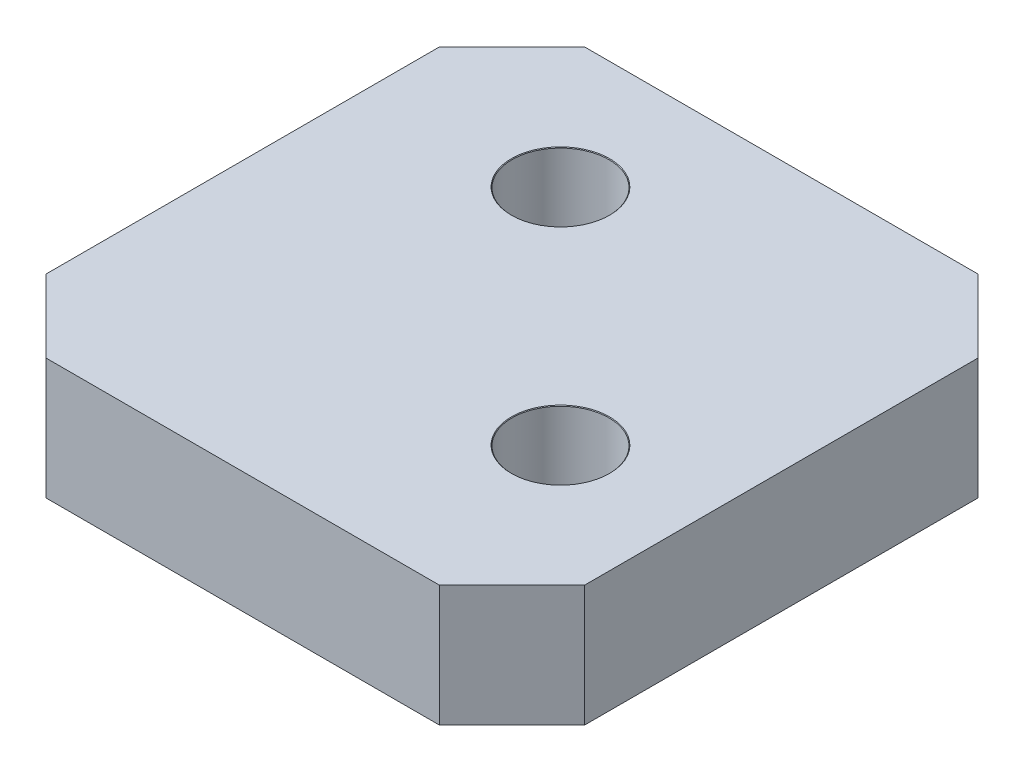
ISO-10303-21;
HEADER;
FILE_DESCRIPTION(('STEP AP214'),'2;1');
FILE_NAME('part.step','',(''),(''),'','','');
FILE_SCHEMA(('AUTOMOTIVE_DESIGN { 1 0 10303 214 1 1 1 1 }'));
ENDSEC;
DATA;
#1=APPLICATION_CONTEXT('core data for automotive mechanical design processes');
#2=APPLICATION_PROTOCOL_DEFINITION('international standard','automotive_design',2000,#1);
#3=PRODUCT_CONTEXT('',#1,'mechanical');
#4=PRODUCT('Part','Part','',(#3));
#5=PRODUCT_RELATED_PRODUCT_CATEGORY('part','',(#4));
#6=PRODUCT_DEFINITION_FORMATION('','',#4);
#7=PRODUCT_DEFINITION_CONTEXT('part definition',#1,'design');
#8=PRODUCT_DEFINITION('design','',#6,#7);
#9=PRODUCT_DEFINITION_SHAPE('','',#8);
#10=(LENGTH_UNIT() NAMED_UNIT(*) SI_UNIT(.MILLI.,.METRE.));
#11=(NAMED_UNIT(*) PLANE_ANGLE_UNIT() SI_UNIT($,.RADIAN.));
#12=(NAMED_UNIT(*) SI_UNIT($,.STERADIAN.) SOLID_ANGLE_UNIT());
#13=UNCERTAINTY_MEASURE_WITH_UNIT(LENGTH_MEASURE(1.E-05),#10,'distance_accuracy_value','');
#14=(GEOMETRIC_REPRESENTATION_CONTEXT(3) GLOBAL_UNCERTAINTY_ASSIGNED_CONTEXT((#13)) GLOBAL_UNIT_ASSIGNED_CONTEXT((#10,
#11,#12)) REPRESENTATION_CONTEXT('',''));
#15=CARTESIAN_POINT('',(0.,0.,0.));
#16=DIRECTION('',(0.,0.,1.));
#17=DIRECTION('',(1.,0.,0.));
#18=AXIS2_PLACEMENT_3D('',#15,#16,#17);
#19=CARTESIAN_POINT('',(0.,5.,0.));
#20=DIRECTION('',(1.,0.,0.));
#21=DIRECTION('',(0.,0.,-1.));
#22=AXIS2_PLACEMENT_3D('',#19,#20,#21);
#23=PLANE('',#22);
#24=DIRECTION('',(0.,0.,1.));
#25=VECTOR('',#24,1.);
#26=CARTESIAN_POINT('',(0.,0.,0.));
#27=LINE('',#26,#25);
#28=CARTESIAN_POINT('',(0.,0.,-19.225));
#29=VERTEX_POINT('',#28);
#30=CARTESIAN_POINT('',(0.,0.,-3.00000000000001));
#31=VERTEX_POINT('',#30);
#32=EDGE_CURVE('E129',#29,#31,#27,.T.);
#33=ORIENTED_EDGE('',*,*,#32,.T.);
#34=DIRECTION('',(0.,1.,0.));
#35=VECTOR('',#34,1.);
#36=CARTESIAN_POINT('',(0.,5.,-3.00000000000001));
#37=LINE('',#36,#35);
#38=CARTESIAN_POINT('',(0.,5.,-3.00000000000001));
#39=VERTEX_POINT('',#38);
#40=EDGE_CURVE('E107',#31,#39,#37,.T.);
#41=ORIENTED_EDGE('',*,*,#40,.T.);
#42=DIRECTION('',(0.,0.,1.));
#43=VECTOR('',#42,1.);
#44=CARTESIAN_POINT('',(0.,5.,0.));
#45=LINE('',#44,#43);
#46=CARTESIAN_POINT('',(0.,5.,-19.225));
#47=VERTEX_POINT('',#46);
#48=EDGE_CURVE('E139',#47,#39,#45,.T.);
#49=ORIENTED_EDGE('',*,*,#48,.F.);
#50=DIRECTION('',(0.,-1.,0.));
#51=VECTOR('',#50,1.);
#52=CARTESIAN_POINT('',(0.,5.,-19.225));
#53=LINE('',#52,#51);
#54=EDGE_CURVE('E112',#47,#29,#53,.T.);
#55=ORIENTED_EDGE('',*,*,#54,.T.);
#56=EDGE_LOOP('',(#33,#41,#49,#55));
#57=FACE_BOUND('',#56,.T.);
#58=ADVANCED_FACE('F35',(#57),#23,.F.);
#59=CARTESIAN_POINT('',(0.,5.,0.));
#60=DIRECTION('',(0.,0.,-1.));
#61=DIRECTION('',(-1.,0.,0.));
#62=AXIS2_PLACEMENT_3D('',#59,#60,#61);
#63=PLANE('',#62);
#64=DIRECTION('',(1.,0.,0.));
#65=VECTOR('',#64,1.);
#66=CARTESIAN_POINT('',(0.,5.,0.));
#67=LINE('',#66,#65);
#68=CARTESIAN_POINT('',(3.,5.,0.));
#69=VERTEX_POINT('',#68);
#70=CARTESIAN_POINT('',(19.225,5.,0.));
#71=VERTEX_POINT('',#70);
#72=EDGE_CURVE('E122',#69,#71,#67,.T.);
#73=ORIENTED_EDGE('',*,*,#72,.F.);
#74=DIRECTION('',(0.,-1.,0.));
#75=VECTOR('',#74,1.);
#76=CARTESIAN_POINT('',(3.,5.,0.));
#77=LINE('',#76,#75);
#78=CARTESIAN_POINT('',(3.,0.,0.));
#79=VERTEX_POINT('',#78);
#80=EDGE_CURVE('E106',#69,#79,#77,.T.);
#81=ORIENTED_EDGE('',*,*,#80,.T.);
#82=DIRECTION('',(1.,0.,0.));
#83=VECTOR('',#82,1.);
#84=CARTESIAN_POINT('',(0.,0.,0.));
#85=LINE('',#84,#83);
#86=CARTESIAN_POINT('',(19.225,0.,0.));
#87=VERTEX_POINT('',#86);
#88=EDGE_CURVE('E119',#79,#87,#85,.T.);
#89=ORIENTED_EDGE('',*,*,#88,.T.);
#90=DIRECTION('',(0.,1.,0.));
#91=VECTOR('',#90,1.);
#92=CARTESIAN_POINT('',(19.225,5.,0.));
#93=LINE('',#92,#91);
#94=EDGE_CURVE('E124',#87,#71,#93,.T.);
#95=ORIENTED_EDGE('',*,*,#94,.T.);
#96=EDGE_LOOP('',(#73,#81,#89,#95));
#97=FACE_BOUND('',#96,.T.);
#98=ADVANCED_FACE('F118',(#97),#63,.F.);
#99=CARTESIAN_POINT('',(22.225,5.,0.));
#100=DIRECTION('',(-1.,0.,0.));
#101=DIRECTION('',(0.,0.,1.));
#102=AXIS2_PLACEMENT_3D('',#99,#100,#101);
#103=PLANE('',#102);
#104=DIRECTION('',(0.,0.,-1.));
#105=VECTOR('',#104,1.);
#106=CARTESIAN_POINT('',(22.225,5.,0.));
#107=LINE('',#106,#105);
#108=CARTESIAN_POINT('',(22.225,5.,-3.));
#109=VERTEX_POINT('',#108);
#110=CARTESIAN_POINT('',(22.225,5.,-19.225));
#111=VERTEX_POINT('',#110);
#112=EDGE_CURVE('E165',#109,#111,#107,.T.);
#113=ORIENTED_EDGE('',*,*,#112,.F.);
#114=DIRECTION('',(0.,-1.,0.));
#115=VECTOR('',#114,1.);
#116=CARTESIAN_POINT('',(22.225,5.,-3.));
#117=LINE('',#116,#115);
#118=CARTESIAN_POINT('',(22.225,0.,-3.));
#119=VERTEX_POINT('',#118);
#120=EDGE_CURVE('E158',#109,#119,#117,.T.);
#121=ORIENTED_EDGE('',*,*,#120,.T.);
#122=DIRECTION('',(0.,0.,-1.));
#123=VECTOR('',#122,1.);
#124=CARTESIAN_POINT('',(22.225,0.,0.));
#125=LINE('',#124,#123);
#126=CARTESIAN_POINT('',(22.225,0.,-19.225));
#127=VERTEX_POINT('',#126);
#128=EDGE_CURVE('E128',#119,#127,#125,.T.);
#129=ORIENTED_EDGE('',*,*,#128,.T.);
#130=DIRECTION('',(0.,1.,0.));
#131=VECTOR('',#130,1.);
#132=CARTESIAN_POINT('',(22.225,5.,-19.225));
#133=LINE('',#132,#131);
#134=EDGE_CURVE('E156',#127,#111,#133,.T.);
#135=ORIENTED_EDGE('',*,*,#134,.T.);
#136=EDGE_LOOP('',(#113,#121,#129,#135));
#137=FACE_BOUND('',#136,.T.);
#138=ADVANCED_FACE('F163',(#137),#103,.F.);
#139=CARTESIAN_POINT('',(0.,5.,-22.225));
#140=DIRECTION('',(0.,0.,1.));
#141=DIRECTION('',(1.,0.,0.));
#142=AXIS2_PLACEMENT_3D('',#139,#140,#141);
#143=PLANE('',#142);
#144=DIRECTION('',(-1.,0.,0.));
#145=VECTOR('',#144,1.);
#146=CARTESIAN_POINT('',(0.,5.,-22.225));
#147=LINE('',#146,#145);
#148=CARTESIAN_POINT('',(19.225,5.,-22.225));
#149=VERTEX_POINT('',#148);
#150=CARTESIAN_POINT('',(3.00000000000001,5.,-22.225));
#151=VERTEX_POINT('',#150);
#152=EDGE_CURVE('E140',#149,#151,#147,.T.);
#153=ORIENTED_EDGE('',*,*,#152,.F.);
#154=DIRECTION('',(0.,-1.,0.));
#155=VECTOR('',#154,1.);
#156=CARTESIAN_POINT('',(19.225,5.,-22.225));
#157=LINE('',#156,#155);
#158=CARTESIAN_POINT('',(19.225,0.,-22.225));
#159=VERTEX_POINT('',#158);
#160=EDGE_CURVE('E11',#149,#159,#157,.T.);
#161=ORIENTED_EDGE('',*,*,#160,.T.);
#162=DIRECTION('',(-1.,0.,0.));
#163=VECTOR('',#162,1.);
#164=CARTESIAN_POINT('',(0.,0.,-22.225));
#165=LINE('',#164,#163);
#166=CARTESIAN_POINT('',(3.00000000000001,0.,-22.225));
#167=VERTEX_POINT('',#166);
#168=EDGE_CURVE('E132',#159,#167,#165,.T.);
#169=ORIENTED_EDGE('',*,*,#168,.T.);
#170=DIRECTION('',(0.,1.,0.));
#171=VECTOR('',#170,1.);
#172=CARTESIAN_POINT('',(3.00000000000001,5.,-22.225));
#173=LINE('',#172,#171);
#174=EDGE_CURVE('E44',#167,#151,#173,.T.);
#175=ORIENTED_EDGE('',*,*,#174,.T.);
#176=EDGE_LOOP('',(#153,#161,#169,#175));
#177=FACE_BOUND('',#176,.T.);
#178=ADVANCED_FACE('F172',(#177),#143,.F.);
#179=CARTESIAN_POINT('',(0.,5.,0.));
#180=DIRECTION('',(0.,-1.,0.));
#181=DIRECTION('',(0.,0.,-1.));
#182=AXIS2_PLACEMENT_3D('',#179,#180,#181);
#183=PLANE('',#182);
#184=CARTESIAN_POINT('',(7.5,5.,-16.725));
#185=DIRECTION('',(0.,1.,0.));
#186=DIRECTION('',(0.,0.,1.));
#187=AXIS2_PLACEMENT_3D('',#184,#185,#186);
#188=CIRCLE('',#187,2.025);
#189=CARTESIAN_POINT('',(7.5,5.,-14.7));
#190=VERTEX_POINT('',#189);
#191=EDGE_CURVE('E193',#190,#190,#188,.T.);
#192=ORIENTED_EDGE('',*,*,#191,.F.);
#193=EDGE_LOOP('',(#192));
#194=FACE_BOUND('',#193,.T.);
#195=CARTESIAN_POINT('',(16.725,5.,-7.5));
#196=DIRECTION('',(0.,1.,0.));
#197=DIRECTION('',(0.,0.,1.));
#198=AXIS2_PLACEMENT_3D('',#195,#196,#197);
#199=CIRCLE('',#198,2.025);
#200=CARTESIAN_POINT('',(16.725,5.,-5.475));
#201=VERTEX_POINT('',#200);
#202=EDGE_CURVE('E184',#201,#201,#199,.T.);
#203=ORIENTED_EDGE('',*,*,#202,.F.);
#204=EDGE_LOOP('',(#203));
#205=FACE_BOUND('',#204,.T.);
#206=ORIENTED_EDGE('',*,*,#48,.T.);
#207=DIRECTION('',(-0.707106781186546,0.,-0.707106781186549));
#208=VECTOR('',#207,1.);
#209=CARTESIAN_POINT('',(3.,5.,0.));
#210=LINE('',#209,#208);
#211=EDGE_CURVE('E154',#39,#69,#210,.F.);
#212=ORIENTED_EDGE('',*,*,#211,.T.);
#213=ORIENTED_EDGE('',*,*,#72,.T.);
#214=DIRECTION('',(-0.707106781186549,0.,0.707106781186546));
#215=VECTOR('',#214,1.);
#216=CARTESIAN_POINT('',(22.225,5.,-3.));
#217=LINE('',#216,#215);
#218=EDGE_CURVE('E152',#71,#109,#217,.F.);
#219=ORIENTED_EDGE('',*,*,#218,.T.);
#220=ORIENTED_EDGE('',*,*,#112,.T.);
#221=DIRECTION('',(0.707106781186547,0.,0.707106781186548));
#222=VECTOR('',#221,1.);
#223=CARTESIAN_POINT('',(19.225,5.,-22.225));
#224=LINE('',#223,#222);
#225=EDGE_CURVE('E57',#111,#149,#224,.F.);
#226=ORIENTED_EDGE('',*,*,#225,.T.);
#227=ORIENTED_EDGE('',*,*,#152,.T.);
#228=DIRECTION('',(0.707106781186549,0.,-0.707106781186546));
#229=VECTOR('',#228,1.);
#230=CARTESIAN_POINT('',(0.,5.,-19.225));
#231=LINE('',#230,#229);
#232=EDGE_CURVE('E149',#151,#47,#231,.F.);
#233=ORIENTED_EDGE('',*,*,#232,.T.);
#234=EDGE_LOOP('',(#206,#212,#213,#219,#220,#226,#227,#233));
#235=FACE_BOUND('',#234,.T.);
#236=ADVANCED_FACE('F199',(#194,#205,#235),#183,.F.);
#237=CARTESIAN_POINT('',(0.,0.,0.));
#238=DIRECTION('',(0.,-1.,0.));
#239=DIRECTION('',(0.,0.,-1.));
#240=AXIS2_PLACEMENT_3D('',#237,#238,#239);
#241=PLANE('',#240);
#242=CARTESIAN_POINT('',(7.5,0.,-16.725));
#243=DIRECTION('',(0.,1.,0.));
#244=DIRECTION('',(0.,0.,1.));
#245=AXIS2_PLACEMENT_3D('',#242,#243,#244);
#246=CIRCLE('',#245,2.);
#247=CARTESIAN_POINT('',(7.5,0.,-14.725));
#248=VERTEX_POINT('',#247);
#249=EDGE_CURVE('E187',#248,#248,#246,.T.);
#250=ORIENTED_EDGE('',*,*,#249,.T.);
#251=EDGE_LOOP('',(#250));
#252=FACE_BOUND('',#251,.T.);
#253=CARTESIAN_POINT('',(16.725,0.,-7.5));
#254=DIRECTION('',(0.,1.,0.));
#255=DIRECTION('',(0.,0.,1.));
#256=AXIS2_PLACEMENT_3D('',#253,#254,#255);
#257=CIRCLE('',#256,2.);
#258=CARTESIAN_POINT('',(16.725,0.,-5.5));
#259=VERTEX_POINT('',#258);
#260=EDGE_CURVE('E134',#259,#259,#257,.T.);
#261=ORIENTED_EDGE('',*,*,#260,.T.);
#262=EDGE_LOOP('',(#261));
#263=FACE_BOUND('',#262,.T.);
#264=ORIENTED_EDGE('',*,*,#88,.F.);
#265=DIRECTION('',(0.707106781186546,0.,0.707106781186549));
#266=VECTOR('',#265,1.);
#267=CARTESIAN_POINT('',(1.5,0.,-1.5));
#268=LINE('',#267,#266);
#269=EDGE_CURVE('E102',#79,#31,#268,.F.);
#270=ORIENTED_EDGE('',*,*,#269,.T.);
#271=ORIENTED_EDGE('',*,*,#32,.F.);
#272=DIRECTION('',(-0.707106781186549,0.,0.707106781186546));
#273=VECTOR('',#272,1.);
#274=CARTESIAN_POINT('',(-9.6125,0.,-9.61250000000003));
#275=LINE('',#274,#273);
#276=EDGE_CURVE('E123',#29,#167,#275,.F.);
#277=ORIENTED_EDGE('',*,*,#276,.T.);
#278=ORIENTED_EDGE('',*,*,#168,.F.);
#279=DIRECTION('',(-0.707106781186547,0.,-0.707106781186548));
#280=VECTOR('',#279,1.);
#281=CARTESIAN_POINT('',(20.725,0.,-20.725));
#282=LINE('',#281,#280);
#283=EDGE_CURVE('E143',#159,#127,#282,.F.);
#284=ORIENTED_EDGE('',*,*,#283,.T.);
#285=ORIENTED_EDGE('',*,*,#128,.F.);
#286=DIRECTION('',(0.707106781186549,0.,-0.707106781186546));
#287=VECTOR('',#286,1.);
#288=CARTESIAN_POINT('',(9.61249999999996,0.,9.6125));
#289=LINE('',#288,#287);
#290=EDGE_CURVE('E113',#119,#87,#289,.F.);
#291=ORIENTED_EDGE('',*,*,#290,.T.);
#292=EDGE_LOOP('',(#264,#270,#271,#277,#278,#284,#285,#291));
#293=FACE_BOUND('',#292,.T.);
#294=ADVANCED_FACE('F126',(#252,#263,#293),#241,.T.);
#295=CARTESIAN_POINT('',(16.725,5.,-7.5));
#296=DIRECTION('',(0.,1.,0.));
#297=DIRECTION('',(0.,0.,1.));
#298=AXIS2_PLACEMENT_3D('',#295,#296,#297);
#299=CYLINDRICAL_SURFACE('',#298,2.);
#300=ORIENTED_EDGE('',*,*,#260,.F.);
#301=EDGE_LOOP('',(#300));
#302=FACE_BOUND('',#301,.T.);
#303=CARTESIAN_POINT('',(16.725,4.975,-7.5));
#304=DIRECTION('',(0.,1.,0.));
#305=DIRECTION('',(0.,0.,1.));
#306=AXIS2_PLACEMENT_3D('',#303,#304,#305);
#307=CIRCLE('',#306,2.);
#308=CARTESIAN_POINT('',(16.725,4.975,-5.5));
#309=VERTEX_POINT('',#308);
#310=EDGE_CURVE('E181',#309,#309,#307,.T.);
#311=ORIENTED_EDGE('',*,*,#310,.T.);
#312=EDGE_LOOP('',(#311));
#313=FACE_BOUND('',#312,.T.);
#314=ADVANCED_FACE('F282',(#302,#313),#299,.F.);
#315=CARTESIAN_POINT('',(16.725,5.,-7.5));
#316=DIRECTION('',(0.,1.,0.));
#317=DIRECTION('',(0.,0.,1.));
#318=AXIS2_PLACEMENT_3D('',#315,#316,#317);
#319=CONICAL_SURFACE('',#318,2.025,0.785398163397448);
#320=ORIENTED_EDGE('',*,*,#310,.F.);
#321=EDGE_LOOP('',(#320));
#322=FACE_BOUND('',#321,.T.);
#323=ORIENTED_EDGE('',*,*,#202,.T.);
#324=EDGE_LOOP('',(#323));
#325=FACE_BOUND('',#324,.T.);
#326=ADVANCED_FACE('F273',(#322,#325),#319,.F.);
#327=CARTESIAN_POINT('',(7.5,5.,-16.725));
#328=DIRECTION('',(0.,1.,0.));
#329=DIRECTION('',(0.,0.,1.));
#330=AXIS2_PLACEMENT_3D('',#327,#328,#329);
#331=CYLINDRICAL_SURFACE('',#330,2.);
#332=ORIENTED_EDGE('',*,*,#249,.F.);
#333=EDGE_LOOP('',(#332));
#334=FACE_BOUND('',#333,.T.);
#335=CARTESIAN_POINT('',(7.5,4.975,-16.725));
#336=DIRECTION('',(0.,1.,0.));
#337=DIRECTION('',(0.,0.,1.));
#338=AXIS2_PLACEMENT_3D('',#335,#336,#337);
#339=CIRCLE('',#338,2.);
#340=CARTESIAN_POINT('',(7.5,4.975,-14.725));
#341=VERTEX_POINT('',#340);
#342=EDGE_CURVE('E190',#341,#341,#339,.T.);
#343=ORIENTED_EDGE('',*,*,#342,.T.);
#344=EDGE_LOOP('',(#343));
#345=FACE_BOUND('',#344,.T.);
#346=ADVANCED_FACE('F264',(#334,#345),#331,.F.);
#347=CARTESIAN_POINT('',(7.5,5.,-16.725));
#348=DIRECTION('',(0.,1.,0.));
#349=DIRECTION('',(0.,0.,1.));
#350=AXIS2_PLACEMENT_3D('',#347,#348,#349);
#351=CONICAL_SURFACE('',#350,2.025,0.785398163397448);
#352=ORIENTED_EDGE('',*,*,#342,.F.);
#353=EDGE_LOOP('',(#352));
#354=FACE_BOUND('',#353,.T.);
#355=ORIENTED_EDGE('',*,*,#191,.T.);
#356=EDGE_LOOP('',(#355));
#357=FACE_BOUND('',#356,.T.);
#358=ADVANCED_FACE('F197',(#354,#357),#351,.F.);
#359=CARTESIAN_POINT('',(3.,5.,0.));
#360=DIRECTION('',(0.707106781186549,0.,-0.707106781186546));
#361=DIRECTION('',(0.,-1.,0.));
#362=AXIS2_PLACEMENT_3D('',#359,#360,#361);
#363=PLANE('',#362);
#364=ORIENTED_EDGE('',*,*,#211,.F.);
#365=ORIENTED_EDGE('',*,*,#40,.F.);
#366=ORIENTED_EDGE('',*,*,#269,.F.);
#367=ORIENTED_EDGE('',*,*,#80,.F.);
#368=EDGE_LOOP('',(#364,#365,#366,#367));
#369=FACE_BOUND('',#368,.T.);
#370=ADVANCED_FACE('F105',(#369),#363,.F.);
#371=CARTESIAN_POINT('',(22.225,5.,-3.));
#372=DIRECTION('',(-0.707106781186546,0.,-0.707106781186549));
#373=DIRECTION('',(0.,-1.,0.));
#374=AXIS2_PLACEMENT_3D('',#371,#372,#373);
#375=PLANE('',#374);
#376=ORIENTED_EDGE('',*,*,#218,.F.);
#377=ORIENTED_EDGE('',*,*,#94,.F.);
#378=ORIENTED_EDGE('',*,*,#290,.F.);
#379=ORIENTED_EDGE('',*,*,#120,.F.);
#380=EDGE_LOOP('',(#376,#377,#378,#379));
#381=FACE_BOUND('',#380,.T.);
#382=ADVANCED_FACE('F212',(#381),#375,.F.);
#383=CARTESIAN_POINT('',(19.225,5.,-22.225));
#384=DIRECTION('',(-0.707106781186548,0.,0.707106781186547));
#385=DIRECTION('',(0.,-1.,0.));
#386=AXIS2_PLACEMENT_3D('',#383,#384,#385);
#387=PLANE('',#386);
#388=ORIENTED_EDGE('',*,*,#225,.F.);
#389=ORIENTED_EDGE('',*,*,#134,.F.);
#390=ORIENTED_EDGE('',*,*,#283,.F.);
#391=ORIENTED_EDGE('',*,*,#160,.F.);
#392=EDGE_LOOP('',(#388,#389,#390,#391));
#393=FACE_BOUND('',#392,.T.);
#394=ADVANCED_FACE('F171',(#393),#387,.F.);
#395=CARTESIAN_POINT('',(0.,5.,-19.225));
#396=DIRECTION('',(0.707106781186546,0.,0.707106781186549));
#397=DIRECTION('',(0.,-1.,0.));
#398=AXIS2_PLACEMENT_3D('',#395,#396,#397);
#399=PLANE('',#398);
#400=ORIENTED_EDGE('',*,*,#232,.F.);
#401=ORIENTED_EDGE('',*,*,#174,.F.);
#402=ORIENTED_EDGE('',*,*,#276,.F.);
#403=ORIENTED_EDGE('',*,*,#54,.F.);
#404=EDGE_LOOP('',(#400,#401,#402,#403));
#405=FACE_BOUND('',#404,.T.);
#406=ADVANCED_FACE('F38',(#405),#399,.F.);
#407=CLOSED_SHELL('',(#58,#98,#138,#178,#236,#294,#314,#326,#346,#358,#370,#382,#394,#406));
#408=MANIFOLD_SOLID_BREP('B2',#407);
#409=ADVANCED_BREP_SHAPE_REPRESENTATION('',(#18,#408),#14);
#410=SHAPE_DEFINITION_REPRESENTATION(#9,#409);
ENDSEC;
END-ISO-10303-21;
